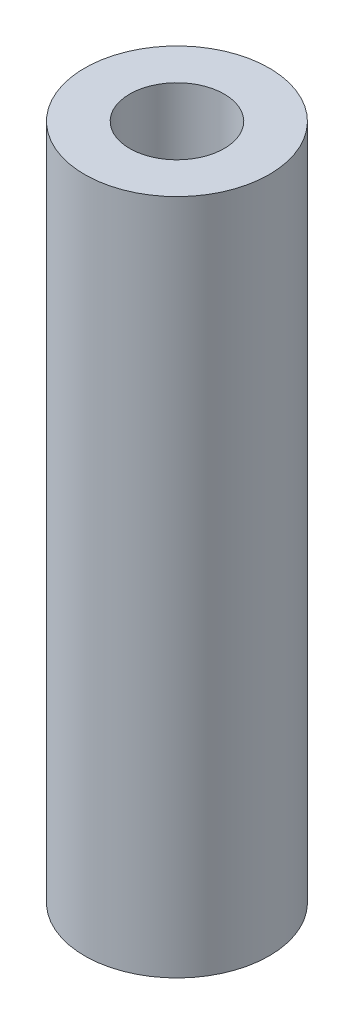
ISO-10303-21;
HEADER;
FILE_DESCRIPTION(('STEP AP214'),'2;1');
FILE_NAME('part.step','',(''),(''),'','','');
FILE_SCHEMA(('AUTOMOTIVE_DESIGN { 1 0 10303 214 1 1 1 1 }'));
ENDSEC;
DATA;
#1=APPLICATION_CONTEXT('core data for automotive mechanical design processes');
#2=APPLICATION_PROTOCOL_DEFINITION('international standard','automotive_design',2000,#1);
#3=PRODUCT_CONTEXT('',#1,'mechanical');
#4=PRODUCT('Part','Part','',(#3));
#5=PRODUCT_RELATED_PRODUCT_CATEGORY('part','',(#4));
#6=PRODUCT_DEFINITION_FORMATION('','',#4);
#7=PRODUCT_DEFINITION_CONTEXT('part definition',#1,'design');
#8=PRODUCT_DEFINITION('design','',#6,#7);
#9=PRODUCT_DEFINITION_SHAPE('','',#8);
#10=(LENGTH_UNIT() NAMED_UNIT(*) SI_UNIT(.MILLI.,.METRE.));
#11=(NAMED_UNIT(*) PLANE_ANGLE_UNIT() SI_UNIT($,.RADIAN.));
#12=(NAMED_UNIT(*) SI_UNIT($,.STERADIAN.) SOLID_ANGLE_UNIT());
#13=UNCERTAINTY_MEASURE_WITH_UNIT(LENGTH_MEASURE(1.E-05),#10,'distance_accuracy_value','');
#14=(GEOMETRIC_REPRESENTATION_CONTEXT(3) GLOBAL_UNCERTAINTY_ASSIGNED_CONTEXT((#13)) GLOBAL_UNIT_ASSIGNED_CONTEXT((#10,
#11,#12)) REPRESENTATION_CONTEXT('',''));
#15=CARTESIAN_POINT('',(0.,0.,0.));
#16=DIRECTION('',(0.,0.,1.));
#17=DIRECTION('',(1.,0.,0.));
#18=AXIS2_PLACEMENT_3D('',#15,#16,#17);
#19=CARTESIAN_POINT('',(0.,0.,0.));
#20=DIRECTION('',(0.,1.,0.));
#21=DIRECTION('',(1.,0.,0.));
#22=AXIS2_PLACEMENT_3D('',#19,#20,#21);
#23=PLANE('',#22);
#24=CARTESIAN_POINT('',(0.,0.,0.));
#25=DIRECTION('',(0.,-1.,0.));
#26=DIRECTION('',(1.,0.,0.));
#27=AXIS2_PLACEMENT_3D('',#24,#25,#26);
#28=CIRCLE('',#27,2.4384);
#29=CARTESIAN_POINT('',(-2.4384,0.,0.));
#30=VERTEX_POINT('',#29);
#31=EDGE_CURVE('E48',#30,#30,#28,.T.);
#32=ORIENTED_EDGE('',*,*,#31,.F.);
#33=EDGE_LOOP('',(#32));
#34=FACE_BOUND('',#33,.T.);
#35=CARTESIAN_POINT('',(0.,0.,0.));
#36=DIRECTION('',(0.,1.,0.));
#37=DIRECTION('',(-1.,0.,0.));
#38=AXIS2_PLACEMENT_3D('',#35,#36,#37);
#39=CIRCLE('',#38,4.7625);
#40=CARTESIAN_POINT('',(4.7625,0.,0.));
#41=VERTEX_POINT('',#40);
#42=EDGE_CURVE('E11',#41,#41,#39,.T.);
#43=ORIENTED_EDGE('',*,*,#42,.F.);
#44=EDGE_LOOP('',(#43));
#45=FACE_BOUND('',#44,.T.);
#46=ADVANCED_FACE('F17',(#34,#45),#23,.F.);
#47=CARTESIAN_POINT('',(0.,34.925,0.));
#48=DIRECTION('',(0.,1.,0.));
#49=DIRECTION('',(1.,0.,0.));
#50=AXIS2_PLACEMENT_3D('',#47,#48,#49);
#51=PLANE('',#50);
#52=CARTESIAN_POINT('',(0.,34.925,0.));
#53=DIRECTION('',(0.,-1.,0.));
#54=DIRECTION('',(1.,0.,0.));
#55=AXIS2_PLACEMENT_3D('',#52,#53,#54);
#56=CIRCLE('',#55,2.4384);
#57=CARTESIAN_POINT('',(-2.4384,34.925,0.));
#58=VERTEX_POINT('',#57);
#59=EDGE_CURVE('E55',#58,#58,#56,.T.);
#60=ORIENTED_EDGE('',*,*,#59,.T.);
#61=EDGE_LOOP('',(#60));
#62=FACE_BOUND('',#61,.T.);
#63=CARTESIAN_POINT('',(0.,34.925,0.));
#64=DIRECTION('',(0.,1.,0.));
#65=DIRECTION('',(-1.,0.,0.));
#66=AXIS2_PLACEMENT_3D('',#63,#64,#65);
#67=CIRCLE('',#66,4.7625);
#68=CARTESIAN_POINT('',(4.7625,34.925,0.));
#69=VERTEX_POINT('',#68);
#70=EDGE_CURVE('E20',#69,#69,#67,.T.);
#71=ORIENTED_EDGE('',*,*,#70,.T.);
#72=EDGE_LOOP('',(#71));
#73=FACE_BOUND('',#72,.T.);
#74=ADVANCED_FACE('F59',(#62,#73),#51,.T.);
#75=CARTESIAN_POINT('',(0.,0.,0.));
#76=DIRECTION('',(0.,1.,0.));
#77=DIRECTION('',(-1.,0.,0.));
#78=AXIS2_PLACEMENT_3D('',#75,#76,#77);
#79=CYLINDRICAL_SURFACE('',#78,4.7625);
#80=ORIENTED_EDGE('',*,*,#70,.F.);
#81=DIRECTION('',(0.,-1.,0.));
#82=VECTOR('',#81,1.);
#83=CARTESIAN_POINT('',(4.7625,0.,0.));
#84=LINE('',#83,#82);
#85=EDGE_CURVE('E27',#69,#41,#84,.T.);
#86=ORIENTED_EDGE('',*,*,#85,.T.);
#87=ORIENTED_EDGE('',*,*,#42,.T.);
#88=ORIENTED_EDGE('',*,*,#85,.F.);
#89=EDGE_LOOP('',(#80,#86,#87,#88));
#90=FACE_BOUND('',#89,.T.);
#91=ADVANCED_FACE('F74',(#90),#79,.T.);
#92=CARTESIAN_POINT('',(0.,0.,0.));
#93=DIRECTION('',(0.,1.,0.));
#94=DIRECTION('',(1.,0.,0.));
#95=AXIS2_PLACEMENT_3D('',#92,#93,#94);
#96=CYLINDRICAL_SURFACE('',#95,2.4384);
#97=ORIENTED_EDGE('',*,*,#59,.F.);
#98=DIRECTION('',(0.,-1.,0.));
#99=VECTOR('',#98,1.);
#100=CARTESIAN_POINT('',(-2.4384,0.,0.));
#101=LINE('',#100,#99);
#102=EDGE_CURVE('E52',#58,#30,#101,.T.);
#103=ORIENTED_EDGE('',*,*,#102,.T.);
#104=ORIENTED_EDGE('',*,*,#31,.T.);
#105=ORIENTED_EDGE('',*,*,#102,.F.);
#106=EDGE_LOOP('',(#97,#103,#104,#105));
#107=FACE_BOUND('',#106,.T.);
#108=ADVANCED_FACE('F54',(#107),#96,.F.);
#109=CLOSED_SHELL('',(#46,#74,#91,#108));
#110=MANIFOLD_SOLID_BREP('B1',#109);
#111=ADVANCED_BREP_SHAPE_REPRESENTATION('',(#18,#110),#14);
#112=SHAPE_DEFINITION_REPRESENTATION(#9,#111);
ENDSEC;
END-ISO-10303-21;
